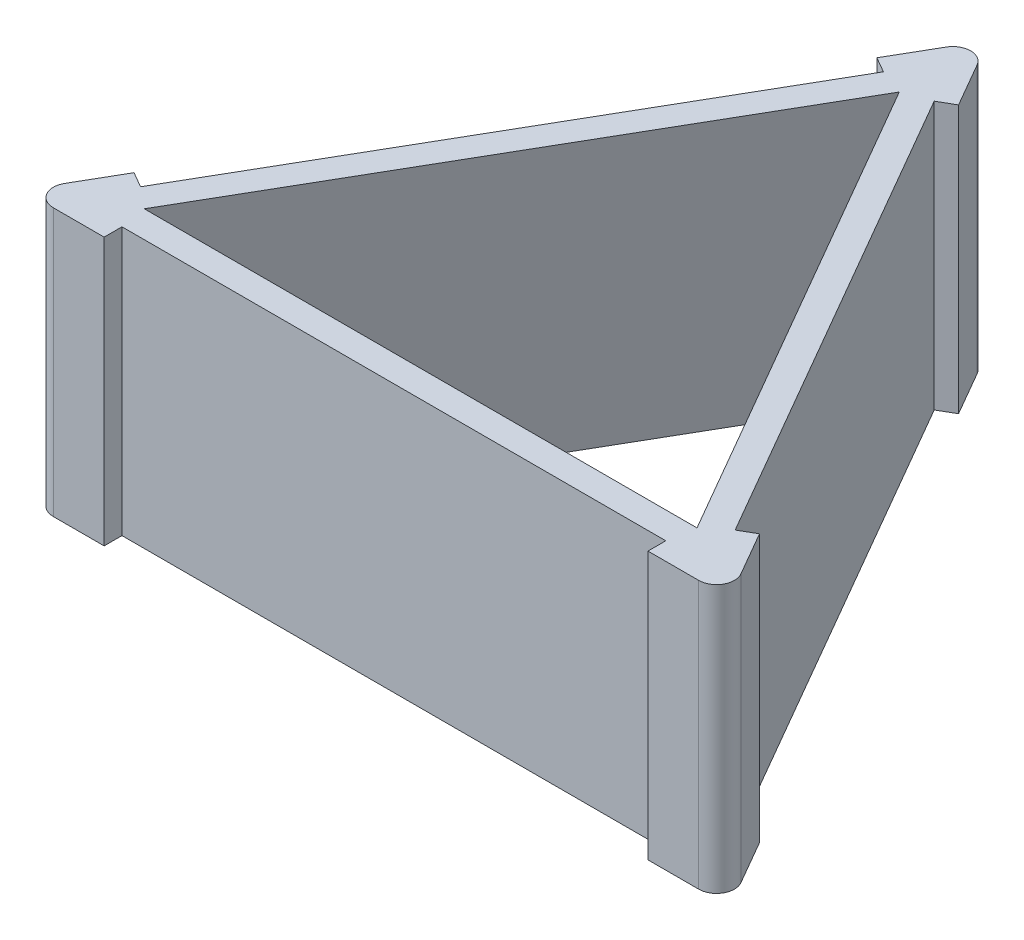
ISO-10303-21;
HEADER;
FILE_DESCRIPTION(('STEP AP214'),'2;1');
FILE_NAME('part.step','',(''),(''),'','','');
FILE_SCHEMA(('AUTOMOTIVE_DESIGN { 1 0 10303 214 1 1 1 1 }'));
ENDSEC;
DATA;
#1=APPLICATION_CONTEXT('core data for automotive mechanical design processes');
#2=APPLICATION_PROTOCOL_DEFINITION('international standard','automotive_design',2000,#1);
#3=PRODUCT_CONTEXT('',#1,'mechanical');
#4=PRODUCT('Part','Part','',(#3));
#5=PRODUCT_RELATED_PRODUCT_CATEGORY('part','',(#4));
#6=PRODUCT_DEFINITION_FORMATION('','',#4);
#7=PRODUCT_DEFINITION_CONTEXT('part definition',#1,'design');
#8=PRODUCT_DEFINITION('design','',#6,#7);
#9=PRODUCT_DEFINITION_SHAPE('','',#8);
#10=(LENGTH_UNIT() NAMED_UNIT(*) SI_UNIT(.MILLI.,.METRE.));
#11=(NAMED_UNIT(*) PLANE_ANGLE_UNIT() SI_UNIT($,.RADIAN.));
#12=(NAMED_UNIT(*) SI_UNIT($,.STERADIAN.) SOLID_ANGLE_UNIT());
#13=UNCERTAINTY_MEASURE_WITH_UNIT(LENGTH_MEASURE(1.E-05),#10,'distance_accuracy_value','');
#14=(GEOMETRIC_REPRESENTATION_CONTEXT(3) GLOBAL_UNCERTAINTY_ASSIGNED_CONTEXT((#13)) GLOBAL_UNIT_ASSIGNED_CONTEXT((#10,
#11,#12)) REPRESENTATION_CONTEXT('',''));
#15=CARTESIAN_POINT('',(0.,0.,0.));
#16=DIRECTION('',(0.,0.,1.));
#17=DIRECTION('',(1.,0.,0.));
#18=AXIS2_PLACEMENT_3D('',#15,#16,#17);
#19=CARTESIAN_POINT('',(50.3685226280623,19.05,29.0802800979955));
#20=DIRECTION('',(-0.866025403784438,0.,0.500000000000001));
#21=DIRECTION('',(0.500000000000001,0.,0.866025403784438));
#22=AXIS2_PLACEMENT_3D('',#19,#20,#21);
#23=PLANE('',#22);
#24=DIRECTION('',(-0.500000000000001,0.,-0.866025403784438));
#25=VECTOR('',#24,1.);
#26=CARTESIAN_POINT('',(50.3685226280623,-19.05,29.0802800979955));
#27=LINE('',#26,#25);
#28=CARTESIAN_POINT('',(5.81676131403093,-19.05,-48.085634064588));
#29=VERTEX_POINT('',#28);
#30=CARTESIAN_POINT('',(2.19970452561231,-19.05,-54.3505601959912));
#31=VERTEX_POINT('',#30);
#32=EDGE_CURVE('E298',#29,#31,#27,.T.);
#33=ORIENTED_EDGE('',*,*,#32,.T.);
#34=DIRECTION('',(0.,-1.,0.));
#35=VECTOR('',#34,1.);
#36=CARTESIAN_POINT('',(2.19970452561231,19.05,-54.3505601959911));
#37=LINE('',#36,#35);
#38=CARTESIAN_POINT('',(2.19970452561231,19.05,-54.3505601959912));
#39=VERTEX_POINT('',#38);
#40=EDGE_CURVE('E325',#31,#39,#37,.F.);
#41=ORIENTED_EDGE('',*,*,#40,.T.);
#42=DIRECTION('',(-0.500000000000001,0.,-0.866025403784438));
#43=VECTOR('',#42,1.);
#44=CARTESIAN_POINT('',(50.3685226280623,19.05,29.0802800979955));
#45=LINE('',#44,#43);
#46=CARTESIAN_POINT('',(5.81676131403093,19.05,-48.085634064588));
#47=VERTEX_POINT('',#46);
#48=EDGE_CURVE('E302',#47,#39,#45,.T.);
#49=ORIENTED_EDGE('',*,*,#48,.F.);
#50=DIRECTION('',(0.,1.,0.));
#51=VECTOR('',#50,1.);
#52=CARTESIAN_POINT('',(5.81676131403093,19.05,-48.085634064588));
#53=LINE('',#52,#51);
#54=EDGE_CURVE('E184',#29,#47,#53,.T.);
#55=ORIENTED_EDGE('',*,*,#54,.F.);
#56=EDGE_LOOP('',(#33,#41,#49,#55));
#57=FACE_BOUND('',#56,.T.);
#58=ADVANCED_FACE('F35',(#57),#23,.F.);
#59=CARTESIAN_POINT('',(-1.66750294128271E-13,19.05,-58.1605601959912));
#60=DIRECTION('',(0.866025403784439,0.,0.499999999999999));
#61=DIRECTION('',(0.499999999999999,0.,-0.866025403784439));
#62=AXIS2_PLACEMENT_3D('',#59,#60,#61);
#63=PLANE('',#62);
#64=DIRECTION('',(-0.499999999999999,0.,0.866025403784439));
#65=VECTOR('',#64,1.);
#66=CARTESIAN_POINT('',(-1.66750294128271E-13,-19.05,-58.1605601959912));
#67=LINE('',#66,#65);
#68=CARTESIAN_POINT('',(-44.551761314031,-19.05,19.0053539665929));
#69=VERTEX_POINT('',#68);
#70=CARTESIAN_POINT('',(-48.16881810245,-19.05,25.2702800979955));
#71=VERTEX_POINT('',#70);
#72=EDGE_CURVE('E311',#69,#71,#67,.T.);
#73=ORIENTED_EDGE('',*,*,#72,.T.);
#74=DIRECTION('',(0.,-1.,0.));
#75=VECTOR('',#74,1.);
#76=CARTESIAN_POINT('',(-48.16881810245,19.05,25.2702800979955));
#77=LINE('',#76,#75);
#78=CARTESIAN_POINT('',(-48.16881810245,19.05,25.2702800979955));
#79=VERTEX_POINT('',#78);
#80=EDGE_CURVE('E11',#71,#79,#77,.F.);
#81=ORIENTED_EDGE('',*,*,#80,.T.);
#82=DIRECTION('',(-0.499999999999999,0.,0.866025403784439));
#83=VECTOR('',#82,1.);
#84=CARTESIAN_POINT('',(-1.66750294128271E-13,19.05,-58.1605601959912));
#85=LINE('',#84,#83);
#86=CARTESIAN_POINT('',(-44.551761314031,19.05,19.0053539665929));
#87=VERTEX_POINT('',#86);
#88=EDGE_CURVE('E301',#87,#79,#85,.T.);
#89=ORIENTED_EDGE('',*,*,#88,.F.);
#90=DIRECTION('',(0.,1.,0.));
#91=VECTOR('',#90,1.);
#92=CARTESIAN_POINT('',(-44.551761314031,19.05,19.0053539665929));
#93=LINE('',#92,#91);
#94=EDGE_CURVE('E234',#69,#87,#93,.T.);
#95=ORIENTED_EDGE('',*,*,#94,.F.);
#96=EDGE_LOOP('',(#73,#81,#89,#95));
#97=FACE_BOUND('',#96,.T.);
#98=ADVANCED_FACE('F362',(#97),#63,.F.);
#99=CARTESIAN_POINT('',(-50.3685226280624,19.05,29.0802800979955));
#100=DIRECTION('',(0.,0.,-1.));
#101=DIRECTION('',(-1.,0.,0.));
#102=AXIS2_PLACEMENT_3D('',#99,#100,#101);
#103=PLANE('',#102);
#104=DIRECTION('',(1.,0.,0.));
#105=VECTOR('',#104,1.);
#106=CARTESIAN_POINT('',(-50.3685226280624,-19.05,29.0802800979955));
#107=LINE('',#106,#105);
#108=CARTESIAN_POINT('',(38.735,-19.05,29.0802800979955));
#109=VERTEX_POINT('',#108);
#110=CARTESIAN_POINT('',(45.9691135768374,-19.05,29.0802800979955));
#111=VERTEX_POINT('',#110);
#112=EDGE_CURVE('E314',#109,#111,#107,.T.);
#113=ORIENTED_EDGE('',*,*,#112,.T.);
#114=DIRECTION('',(0.,-1.,0.));
#115=VECTOR('',#114,1.);
#116=CARTESIAN_POINT('',(45.9691135768374,19.05,29.0802800979955));
#117=LINE('',#116,#115);
#118=CARTESIAN_POINT('',(45.9691135768374,19.05,29.0802800979955));
#119=VERTEX_POINT('',#118);
#120=EDGE_CURVE('E58',#111,#119,#117,.F.);
#121=ORIENTED_EDGE('',*,*,#120,.T.);
#122=DIRECTION('',(1.,0.,0.));
#123=VECTOR('',#122,1.);
#124=CARTESIAN_POINT('',(-50.3685226280624,19.05,29.0802800979955));
#125=LINE('',#124,#123);
#126=CARTESIAN_POINT('',(38.735,19.05,29.0802800979955));
#127=VERTEX_POINT('',#126);
#128=EDGE_CURVE('E305',#127,#119,#125,.T.);
#129=ORIENTED_EDGE('',*,*,#128,.F.);
#130=DIRECTION('',(0.,1.,0.));
#131=VECTOR('',#130,1.);
#132=CARTESIAN_POINT('',(38.735,19.05,29.0802800979955));
#133=LINE('',#132,#131);
#134=EDGE_CURVE('E215',#109,#127,#133,.T.);
#135=ORIENTED_EDGE('',*,*,#134,.F.);
#136=EDGE_LOOP('',(#113,#121,#129,#135));
#137=FACE_BOUND('',#136,.T.);
#138=ADVANCED_FACE('F397',(#137),#103,.F.);
#139=CARTESIAN_POINT('',(0.,19.05,0.));
#140=DIRECTION('',(0.,1.,0.));
#141=DIRECTION('',(0.,0.,1.));
#142=AXIS2_PLACEMENT_3D('',#139,#140,#141);
#143=PLANE('',#142);
#144=ORIENTED_EDGE('',*,*,#48,.T.);
#145=CARTESIAN_POINT('',(-1.7130394325271E-13,19.05,-53.0805601959911));
#146=DIRECTION('',(0.,1.,0.));
#147=DIRECTION('',(0.,0.,1.));
#148=AXIS2_PLACEMENT_3D('',#145,#146,#147);
#149=CIRCLE('',#148,2.54);
#150=CARTESIAN_POINT('',(-2.19970452561265,19.05,-54.3505601959911));
#151=VERTEX_POINT('',#150);
#152=EDGE_CURVE('E330',#39,#151,#149,.T.);
#153=ORIENTED_EDGE('',*,*,#152,.T.);
#154=CARTESIAN_POINT('',(-5.8167613140314,19.05,-48.0856340645879));
#155=VERTEX_POINT('',#154);
#156=EDGE_CURVE('E303',#151,#155,#85,.T.);
#157=ORIENTED_EDGE('',*,*,#156,.T.);
#158=DIRECTION('',(-0.866025403784443,0.,-0.499999999999992));
#159=VECTOR('',#158,1.);
#160=CARTESIAN_POINT('',(-3.61705678841911,19.05,-46.815634064588));
#161=LINE('',#160,#159);
#162=CARTESIAN_POINT('',(-3.61705678841911,19.05,-46.815634064588));
#163=VERTEX_POINT('',#162);
#164=EDGE_CURVE('E242',#163,#155,#161,.T.);
#165=ORIENTED_EDGE('',*,*,#164,.F.);
#166=DIRECTION('',(0.499999999999992,0.,-0.866025403784443));
#167=VECTOR('',#166,1.);
#168=CARTESIAN_POINT('',(-3.61705678841911,19.05,-46.815634064588));
#169=LINE('',#168,#167);
#170=CARTESIAN_POINT('',(-42.3520567884185,19.05,20.2753539665929));
#171=VERTEX_POINT('',#170);
#172=EDGE_CURVE('E223',#171,#163,#169,.T.);
#173=ORIENTED_EDGE('',*,*,#172,.F.);
#174=DIRECTION('',(-0.866025403784443,0.,-0.499999999999992));
#175=VECTOR('',#174,1.);
#176=CARTESIAN_POINT('',(-42.3520567884185,19.05,20.2753539665929));
#177=LINE('',#176,#175);
#178=EDGE_CURVE('E233',#171,#87,#177,.T.);
#179=ORIENTED_EDGE('',*,*,#178,.T.);
#180=ORIENTED_EDGE('',*,*,#88,.T.);
#181=CARTESIAN_POINT('',(-45.9691135768375,19.05,26.5402800979955));
#182=DIRECTION('',(0.,1.,0.));
#183=DIRECTION('',(0.,0.,1.));
#184=AXIS2_PLACEMENT_3D('',#181,#182,#183);
#185=CIRCLE('',#184,2.54);
#186=CARTESIAN_POINT('',(-45.9691135768375,19.05,29.0802800979955));
#187=VERTEX_POINT('',#186);
#188=EDGE_CURVE('E327',#79,#187,#185,.T.);
#189=ORIENTED_EDGE('',*,*,#188,.T.);
#190=CARTESIAN_POINT('',(-38.735,19.05,29.0802800979955));
#191=VERTEX_POINT('',#190);
#192=EDGE_CURVE('E306',#187,#191,#125,.T.);
#193=ORIENTED_EDGE('',*,*,#192,.T.);
#194=DIRECTION('',(0.,0.,1.));
#195=VECTOR('',#194,1.);
#196=CARTESIAN_POINT('',(-38.735,19.05,26.5402800979955));
#197=LINE('',#196,#195);
#198=CARTESIAN_POINT('',(-38.735,19.05,26.5402800979955));
#199=VERTEX_POINT('',#198);
#200=EDGE_CURVE('E270',#199,#191,#197,.T.);
#201=ORIENTED_EDGE('',*,*,#200,.F.);
#202=DIRECTION('',(-1.,0.,0.));
#203=VECTOR('',#202,1.);
#204=CARTESIAN_POINT('',(-38.735,19.05,26.5402800979955));
#205=LINE('',#204,#203);
#206=CARTESIAN_POINT('',(38.735,19.05,26.5402800979955));
#207=VERTEX_POINT('',#206);
#208=EDGE_CURVE('E250',#207,#199,#205,.T.);
#209=ORIENTED_EDGE('',*,*,#208,.F.);
#210=DIRECTION('',(0.,0.,1.));
#211=VECTOR('',#210,1.);
#212=CARTESIAN_POINT('',(38.735,19.05,26.5402800979955));
#213=LINE('',#212,#211);
#214=EDGE_CURVE('E260',#207,#127,#213,.T.);
#215=ORIENTED_EDGE('',*,*,#214,.T.);
#216=ORIENTED_EDGE('',*,*,#128,.T.);
#217=CARTESIAN_POINT('',(45.9691135768374,19.05,26.5402800979955));
#218=DIRECTION('',(0.,1.,0.));
#219=DIRECTION('',(0.,0.,1.));
#220=AXIS2_PLACEMENT_3D('',#217,#218,#219);
#221=CIRCLE('',#220,2.54);
#222=CARTESIAN_POINT('',(48.1688181024498,19.05,25.2702800979955));
#223=VERTEX_POINT('',#222);
#224=EDGE_CURVE('E50',#119,#223,#221,.T.);
#225=ORIENTED_EDGE('',*,*,#224,.T.);
#226=CARTESIAN_POINT('',(44.5517613140312,19.05,19.0053539665926));
#227=VERTEX_POINT('',#226);
#228=EDGE_CURVE('E299',#223,#227,#45,.T.);
#229=ORIENTED_EDGE('',*,*,#228,.T.);
#230=DIRECTION('',(0.866025403784436,0.,-0.500000000000004));
#231=VECTOR('',#230,1.);
#232=CARTESIAN_POINT('',(42.3520567884188,19.05,20.2753539665923));
#233=LINE('',#232,#231);
#234=CARTESIAN_POINT('',(42.3520567884188,19.05,20.2753539665923));
#235=VERTEX_POINT('',#234);
#236=EDGE_CURVE('E188',#235,#227,#233,.T.);
#237=ORIENTED_EDGE('',*,*,#236,.F.);
#238=DIRECTION('',(0.500000000000004,0.,0.866025403784436));
#239=VECTOR('',#238,1.);
#240=CARTESIAN_POINT('',(42.3520567884188,19.05,20.2753539665923));
#241=LINE('',#240,#239);
#242=CARTESIAN_POINT('',(3.61705678841846,19.05,-46.815634064588));
#243=VERTEX_POINT('',#242);
#244=EDGE_CURVE('E195',#243,#235,#241,.T.);
#245=ORIENTED_EDGE('',*,*,#244,.F.);
#246=DIRECTION('',(0.866025403784436,0.,-0.500000000000004));
#247=VECTOR('',#246,1.);
#248=CARTESIAN_POINT('',(3.61705678841846,19.05,-46.815634064588));
#249=LINE('',#248,#247);
#250=EDGE_CURVE('E178',#243,#47,#249,.T.);
#251=ORIENTED_EDGE('',*,*,#250,.T.);
#252=EDGE_LOOP('',(#144,#153,#157,#165,#173,#179,#180,#189,#193,#201,#209,#215,#216,#225,#229,
#237,#245,#251));
#253=FACE_BOUND('',#252,.T.);
#254=DIRECTION('',(1.,0.,0.));
#255=VECTOR('',#254,1.);
#256=CARTESIAN_POINT('',(-39.3700000000001,19.05,22.7302800979955));
#257=LINE('',#256,#255);
#258=CARTESIAN_POINT('',(-39.3700000000001,19.05,22.7302800979955));
#259=VERTEX_POINT('',#258);
#260=CARTESIAN_POINT('',(39.3699999999999,19.05,22.7302800979955));
#261=VERTEX_POINT('',#260);
#262=EDGE_CURVE('E277',#259,#261,#257,.T.);
#263=ORIENTED_EDGE('',*,*,#262,.F.);
#264=DIRECTION('',(-0.5,0.,0.866025403784439));
#265=VECTOR('',#264,1.);
#266=CARTESIAN_POINT('',(0.,19.05,-45.4605601959912));
#267=LINE('',#266,#265);
#268=CARTESIAN_POINT('',(0.,19.05,-45.4605601959912));
#269=VERTEX_POINT('',#268);
#270=EDGE_CURVE('E275',#269,#259,#267,.T.);
#271=ORIENTED_EDGE('',*,*,#270,.F.);
#272=DIRECTION('',(-0.5,0.,-0.866025403784439));
#273=VECTOR('',#272,1.);
#274=CARTESIAN_POINT('',(39.3699999999999,19.05,22.7302800979955));
#275=LINE('',#274,#273);
#276=EDGE_CURVE('E281',#261,#269,#275,.T.);
#277=ORIENTED_EDGE('',*,*,#276,.F.);
#278=EDGE_LOOP('',(#263,#271,#277));
#279=FACE_BOUND('',#278,.T.);
#280=ADVANCED_FACE('F201',(#253,#279),#143,.T.);
#281=CARTESIAN_POINT('',(0.,-19.05,0.));
#282=DIRECTION('',(0.,1.,0.));
#283=DIRECTION('',(0.,0.,1.));
#284=AXIS2_PLACEMENT_3D('',#281,#282,#283);
#285=PLANE('',#284);
#286=CARTESIAN_POINT('',(-2.19970452561265,-19.05,-54.3505601959911));
#287=VERTEX_POINT('',#286);
#288=CARTESIAN_POINT('',(-5.8167613140316,-19.05,-48.0856340645879));
#289=VERTEX_POINT('',#288);
#290=EDGE_CURVE('E312',#287,#289,#67,.T.);
#291=ORIENTED_EDGE('',*,*,#290,.F.);
#292=CARTESIAN_POINT('',(-1.7130394325271E-13,-19.05,-53.0805601959911));
#293=DIRECTION('',(0.,1.,0.));
#294=DIRECTION('',(0.,0.,1.));
#295=AXIS2_PLACEMENT_3D('',#292,#293,#294);
#296=CIRCLE('',#295,2.54);
#297=EDGE_CURVE('E323',#287,#31,#296,.F.);
#298=ORIENTED_EDGE('',*,*,#297,.T.);
#299=ORIENTED_EDGE('',*,*,#32,.F.);
#300=DIRECTION('',(0.866025403784436,0.,-0.500000000000004));
#301=VECTOR('',#300,1.);
#302=CARTESIAN_POINT('',(3.61705678841846,-19.05,-46.815634064588));
#303=LINE('',#302,#301);
#304=CARTESIAN_POINT('',(3.61705678841846,-19.05,-46.815634064588));
#305=VERTEX_POINT('',#304);
#306=EDGE_CURVE('E213',#305,#29,#303,.T.);
#307=ORIENTED_EDGE('',*,*,#306,.F.);
#308=DIRECTION('',(-0.500000000000004,0.,-0.866025403784436));
#309=VECTOR('',#308,1.);
#310=CARTESIAN_POINT('',(42.3520567884188,-19.05,20.2753539665923));
#311=LINE('',#310,#309);
#312=CARTESIAN_POINT('',(42.3520567884188,-19.05,20.2753539665923));
#313=VERTEX_POINT('',#312);
#314=EDGE_CURVE('E189',#313,#305,#311,.T.);
#315=ORIENTED_EDGE('',*,*,#314,.F.);
#316=DIRECTION('',(0.866025403784436,0.,-0.500000000000004));
#317=VECTOR('',#316,1.);
#318=CARTESIAN_POINT('',(42.3520567884188,-19.05,20.2753539665923));
#319=LINE('',#318,#317);
#320=CARTESIAN_POINT('',(44.5517613140312,-19.05,19.0053539665923));
#321=VERTEX_POINT('',#320);
#322=EDGE_CURVE('E216',#313,#321,#319,.T.);
#323=ORIENTED_EDGE('',*,*,#322,.T.);
#324=CARTESIAN_POINT('',(48.1688181024498,-19.05,25.2702800979955));
#325=VERTEX_POINT('',#324);
#326=EDGE_CURVE('E309',#325,#321,#27,.T.);
#327=ORIENTED_EDGE('',*,*,#326,.F.);
#328=CARTESIAN_POINT('',(45.9691135768374,-19.05,26.5402800979955));
#329=DIRECTION('',(0.,1.,0.));
#330=DIRECTION('',(0.,0.,1.));
#331=AXIS2_PLACEMENT_3D('',#328,#329,#330);
#332=CIRCLE('',#331,2.54);
#333=EDGE_CURVE('E321',#325,#111,#332,.F.);
#334=ORIENTED_EDGE('',*,*,#333,.T.);
#335=ORIENTED_EDGE('',*,*,#112,.F.);
#336=DIRECTION('',(0.,0.,1.));
#337=VECTOR('',#336,1.);
#338=CARTESIAN_POINT('',(38.735,-19.05,26.5402800979955));
#339=LINE('',#338,#337);
#340=CARTESIAN_POINT('',(38.735,-19.05,26.5402800979955));
#341=VERTEX_POINT('',#340);
#342=EDGE_CURVE('E264',#341,#109,#339,.T.);
#343=ORIENTED_EDGE('',*,*,#342,.F.);
#344=DIRECTION('',(1.,0.,0.));
#345=VECTOR('',#344,1.);
#346=CARTESIAN_POINT('',(-38.735,-19.05,26.5402800979955));
#347=LINE('',#346,#345);
#348=CARTESIAN_POINT('',(-38.735,-19.05,26.5402800979955));
#349=VERTEX_POINT('',#348);
#350=EDGE_CURVE('E257',#349,#341,#347,.T.);
#351=ORIENTED_EDGE('',*,*,#350,.F.);
#352=DIRECTION('',(0.,0.,1.));
#353=VECTOR('',#352,1.);
#354=CARTESIAN_POINT('',(-38.735,-19.05,26.5402800979955));
#355=LINE('',#354,#353);
#356=CARTESIAN_POINT('',(-38.735,-19.05,29.0802800979955));
#357=VERTEX_POINT('',#356);
#358=EDGE_CURVE('E267',#349,#357,#355,.T.);
#359=ORIENTED_EDGE('',*,*,#358,.T.);
#360=CARTESIAN_POINT('',(-45.9691135768375,-19.05,29.0802800979955));
#361=VERTEX_POINT('',#360);
#362=EDGE_CURVE('E315',#361,#357,#107,.T.);
#363=ORIENTED_EDGE('',*,*,#362,.F.);
#364=CARTESIAN_POINT('',(-45.9691135768375,-19.05,26.5402800979955));
#365=DIRECTION('',(0.,1.,0.));
#366=DIRECTION('',(0.,0.,1.));
#367=AXIS2_PLACEMENT_3D('',#364,#365,#366);
#368=CIRCLE('',#367,2.54);
#369=EDGE_CURVE('E319',#361,#71,#368,.F.);
#370=ORIENTED_EDGE('',*,*,#369,.T.);
#371=ORIENTED_EDGE('',*,*,#72,.F.);
#372=DIRECTION('',(-0.866025403784443,0.,-0.499999999999992));
#373=VECTOR('',#372,1.);
#374=CARTESIAN_POINT('',(-42.3520567884185,-19.05,20.2753539665929));
#375=LINE('',#374,#373);
#376=CARTESIAN_POINT('',(-42.3520567884185,-19.05,20.2753539665929));
#377=VERTEX_POINT('',#376);
#378=EDGE_CURVE('E210',#377,#69,#375,.T.);
#379=ORIENTED_EDGE('',*,*,#378,.F.);
#380=DIRECTION('',(-0.499999999999992,0.,0.866025403784443));
#381=VECTOR('',#380,1.);
#382=CARTESIAN_POINT('',(-3.61705678841911,-19.05,-46.815634064588));
#383=LINE('',#382,#381);
#384=CARTESIAN_POINT('',(-3.61705678841911,-19.05,-46.815634064588));
#385=VERTEX_POINT('',#384);
#386=EDGE_CURVE('E230',#385,#377,#383,.T.);
#387=ORIENTED_EDGE('',*,*,#386,.F.);
#388=DIRECTION('',(-0.866025403784443,0.,-0.499999999999992));
#389=VECTOR('',#388,1.);
#390=CARTESIAN_POINT('',(-3.61705678841911,-19.05,-46.815634064588));
#391=LINE('',#390,#389);
#392=EDGE_CURVE('E239',#385,#289,#391,.T.);
#393=ORIENTED_EDGE('',*,*,#392,.T.);
#394=EDGE_LOOP('',(#291,#298,#299,#307,#315,#323,#327,#334,#335,#343,#351,#359,#363,#370,#371,
#379,#387,#393));
#395=FACE_BOUND('',#394,.T.);
#396=DIRECTION('',(-0.5,0.,0.866025403784439));
#397=VECTOR('',#396,1.);
#398=CARTESIAN_POINT('',(0.,-19.05,-45.4605601959912));
#399=LINE('',#398,#397);
#400=CARTESIAN_POINT('',(0.,-19.05,-45.4605601959912));
#401=VERTEX_POINT('',#400);
#402=CARTESIAN_POINT('',(-39.3700000000001,-19.05,22.7302800979955));
#403=VERTEX_POINT('',#402);
#404=EDGE_CURVE('E266',#401,#403,#399,.T.);
#405=ORIENTED_EDGE('',*,*,#404,.T.);
#406=DIRECTION('',(1.,0.,0.));
#407=VECTOR('',#406,1.);
#408=CARTESIAN_POINT('',(-39.3700000000001,-19.05,22.7302800979955));
#409=LINE('',#408,#407);
#410=CARTESIAN_POINT('',(39.3699999999999,-19.05,22.7302800979955));
#411=VERTEX_POINT('',#410);
#412=EDGE_CURVE('E286',#403,#411,#409,.T.);
#413=ORIENTED_EDGE('',*,*,#412,.T.);
#414=DIRECTION('',(-0.5,0.,-0.866025403784439));
#415=VECTOR('',#414,1.);
#416=CARTESIAN_POINT('',(39.3699999999999,-19.05,22.7302800979955));
#417=LINE('',#416,#415);
#418=EDGE_CURVE('E278',#411,#401,#417,.T.);
#419=ORIENTED_EDGE('',*,*,#418,.T.);
#420=EDGE_LOOP('',(#405,#413,#419));
#421=FACE_BOUND('',#420,.T.);
#422=ADVANCED_FACE('F346',(#395,#421),#285,.F.);
#423=ORIENTED_EDGE('',*,*,#228,.F.);
#424=DIRECTION('',(0.,-1.,0.));
#425=VECTOR('',#424,1.);
#426=CARTESIAN_POINT('',(48.1688181024498,19.05,25.2702800979955));
#427=LINE('',#426,#425);
#428=EDGE_CURVE('E332',#223,#325,#427,.T.);
#429=ORIENTED_EDGE('',*,*,#428,.T.);
#430=ORIENTED_EDGE('',*,*,#326,.T.);
#431=DIRECTION('',(0.,-1.,0.));
#432=VECTOR('',#431,1.);
#433=CARTESIAN_POINT('',(44.5517613140312,19.05,19.0053539665923));
#434=LINE('',#433,#432);
#435=EDGE_CURVE('E199',#227,#321,#434,.T.);
#436=ORIENTED_EDGE('',*,*,#435,.F.);
#437=EDGE_LOOP('',(#423,#429,#430,#436));
#438=FACE_BOUND('',#437,.T.);
#439=ADVANCED_FACE('F391',(#438),#23,.F.);
#440=ORIENTED_EDGE('',*,*,#156,.F.);
#441=DIRECTION('',(0.,-1.,0.));
#442=VECTOR('',#441,1.);
#443=CARTESIAN_POINT('',(-2.19970452561265,19.05,-54.3505601959911));
#444=LINE('',#443,#442);
#445=EDGE_CURVE('E308',#151,#287,#444,.T.);
#446=ORIENTED_EDGE('',*,*,#445,.T.);
#447=ORIENTED_EDGE('',*,*,#290,.T.);
#448=DIRECTION('',(0.,-1.,0.));
#449=VECTOR('',#448,1.);
#450=CARTESIAN_POINT('',(-5.8167613140316,19.05,-48.0856340645879));
#451=LINE('',#450,#449);
#452=EDGE_CURVE('E224',#155,#289,#451,.T.);
#453=ORIENTED_EDGE('',*,*,#452,.F.);
#454=EDGE_LOOP('',(#440,#446,#447,#453));
#455=FACE_BOUND('',#454,.T.);
#456=ADVANCED_FACE('F379',(#455),#63,.F.);
#457=ORIENTED_EDGE('',*,*,#192,.F.);
#458=DIRECTION('',(0.,-1.,0.));
#459=VECTOR('',#458,1.);
#460=CARTESIAN_POINT('',(-45.9691135768375,19.05,29.0802800979955));
#461=LINE('',#460,#459);
#462=EDGE_CURVE('E43',#187,#361,#461,.T.);
#463=ORIENTED_EDGE('',*,*,#462,.T.);
#464=ORIENTED_EDGE('',*,*,#362,.T.);
#465=DIRECTION('',(0.,-1.,0.));
#466=VECTOR('',#465,1.);
#467=CARTESIAN_POINT('',(-38.735,19.05,29.0802800979955));
#468=LINE('',#467,#466);
#469=EDGE_CURVE('E251',#191,#357,#468,.T.);
#470=ORIENTED_EDGE('',*,*,#469,.F.);
#471=EDGE_LOOP('',(#457,#463,#464,#470));
#472=FACE_BOUND('',#471,.T.);
#473=ADVANCED_FACE('F340',(#472),#103,.F.);
#474=CARTESIAN_POINT('',(0.,19.05,-45.4605601959912));
#475=DIRECTION('',(0.866025403784439,0.,0.5));
#476=DIRECTION('',(0.5,0.,-0.866025403784438));
#477=AXIS2_PLACEMENT_3D('',#474,#475,#476);
#478=PLANE('',#477);
#479=ORIENTED_EDGE('',*,*,#404,.F.);
#480=DIRECTION('',(0.,-1.,0.));
#481=VECTOR('',#480,1.);
#482=CARTESIAN_POINT('',(0.,19.05,-45.4605601959912));
#483=LINE('',#482,#481);
#484=EDGE_CURVE('E283',#269,#401,#483,.T.);
#485=ORIENTED_EDGE('',*,*,#484,.F.);
#486=ORIENTED_EDGE('',*,*,#270,.T.);
#487=DIRECTION('',(0.,-1.,0.));
#488=VECTOR('',#487,1.);
#489=CARTESIAN_POINT('',(-39.3700000000001,19.05,22.7302800979955));
#490=LINE('',#489,#488);
#491=EDGE_CURVE('E295',#259,#403,#490,.T.);
#492=ORIENTED_EDGE('',*,*,#491,.T.);
#493=EDGE_LOOP('',(#479,#485,#486,#492));
#494=FACE_BOUND('',#493,.T.);
#495=ADVANCED_FACE('F431',(#494),#478,.T.);
#496=CARTESIAN_POINT('',(-39.3700000000001,19.05,22.7302800979955));
#497=DIRECTION('',(0.,0.,-1.));
#498=DIRECTION('',(-1.,0.,0.));
#499=AXIS2_PLACEMENT_3D('',#496,#497,#498);
#500=PLANE('',#499);
#501=ORIENTED_EDGE('',*,*,#412,.F.);
#502=ORIENTED_EDGE('',*,*,#491,.F.);
#503=ORIENTED_EDGE('',*,*,#262,.T.);
#504=DIRECTION('',(0.,-1.,0.));
#505=VECTOR('',#504,1.);
#506=CARTESIAN_POINT('',(39.3699999999999,19.05,22.7302800979955));
#507=LINE('',#506,#505);
#508=EDGE_CURVE('E293',#261,#411,#507,.T.);
#509=ORIENTED_EDGE('',*,*,#508,.T.);
#510=EDGE_LOOP('',(#501,#502,#503,#509));
#511=FACE_BOUND('',#510,.T.);
#512=ADVANCED_FACE('F408',(#511),#500,.T.);
#513=CARTESIAN_POINT('',(39.3699999999999,19.05,22.7302800979955));
#514=DIRECTION('',(-0.866025403784439,0.,0.5));
#515=DIRECTION('',(0.5,0.,0.866025403784439));
#516=AXIS2_PLACEMENT_3D('',#513,#514,#515);
#517=PLANE('',#516);
#518=ORIENTED_EDGE('',*,*,#418,.F.);
#519=ORIENTED_EDGE('',*,*,#508,.F.);
#520=ORIENTED_EDGE('',*,*,#276,.T.);
#521=ORIENTED_EDGE('',*,*,#484,.T.);
#522=EDGE_LOOP('',(#518,#519,#520,#521));
#523=FACE_BOUND('',#522,.T.);
#524=ADVANCED_FACE('F401',(#523),#517,.T.);
#525=CARTESIAN_POINT('',(38.735,19.05,26.5402800979955));
#526=DIRECTION('',(1.,0.,0.));
#527=DIRECTION('',(0.,1.,0.));
#528=AXIS2_PLACEMENT_3D('',#525,#526,#527);
#529=PLANE('',#528);
#530=ORIENTED_EDGE('',*,*,#134,.T.);
#531=ORIENTED_EDGE('',*,*,#214,.F.);
#532=DIRECTION('',(0.,1.,0.));
#533=VECTOR('',#532,1.);
#534=CARTESIAN_POINT('',(38.735,19.05,26.5402800979955));
#535=LINE('',#534,#533);
#536=EDGE_CURVE('E247',#341,#207,#535,.T.);
#537=ORIENTED_EDGE('',*,*,#536,.F.);
#538=ORIENTED_EDGE('',*,*,#342,.T.);
#539=EDGE_LOOP('',(#530,#531,#537,#538));
#540=FACE_BOUND('',#539,.T.);
#541=ADVANCED_FACE('F399',(#540),#529,.F.);
#542=CARTESIAN_POINT('',(-38.735,19.05,26.5402800979955));
#543=DIRECTION('',(-1.,0.,0.));
#544=DIRECTION('',(0.,0.,1.));
#545=AXIS2_PLACEMENT_3D('',#542,#543,#544);
#546=PLANE('',#545);
#547=ORIENTED_EDGE('',*,*,#469,.T.);
#548=ORIENTED_EDGE('',*,*,#358,.F.);
#549=DIRECTION('',(0.,-1.,0.));
#550=VECTOR('',#549,1.);
#551=CARTESIAN_POINT('',(-38.735,19.05,26.5402800979955));
#552=LINE('',#551,#550);
#553=EDGE_CURVE('E254',#199,#349,#552,.T.);
#554=ORIENTED_EDGE('',*,*,#553,.F.);
#555=ORIENTED_EDGE('',*,*,#200,.T.);
#556=EDGE_LOOP('',(#547,#548,#554,#555));
#557=FACE_BOUND('',#556,.T.);
#558=ADVANCED_FACE('F353',(#557),#546,.F.);
#559=CARTESIAN_POINT('',(0.,0.,26.5402800979955));
#560=DIRECTION('',(0.,0.,1.));
#561=DIRECTION('',(1.,0.,0.));
#562=AXIS2_PLACEMENT_3D('',#559,#560,#561);
#563=PLANE('',#562);
#564=ORIENTED_EDGE('',*,*,#536,.T.);
#565=ORIENTED_EDGE('',*,*,#208,.T.);
#566=ORIENTED_EDGE('',*,*,#553,.T.);
#567=ORIENTED_EDGE('',*,*,#350,.T.);
#568=EDGE_LOOP('',(#564,#565,#566,#567));
#569=FACE_BOUND('',#568,.T.);
#570=ADVANCED_FACE('F355',(#569),#563,.T.);
#571=CARTESIAN_POINT('',(-42.3520567884185,19.05,20.2753539665929));
#572=DIRECTION('',(-0.499999999999992,0.,0.866025403784443));
#573=DIRECTION('',(0.866025403784443,0.,0.499999999999992));
#574=AXIS2_PLACEMENT_3D('',#571,#572,#573);
#575=PLANE('',#574);
#576=ORIENTED_EDGE('',*,*,#94,.T.);
#577=ORIENTED_EDGE('',*,*,#178,.F.);
#578=DIRECTION('',(0.,1.,0.));
#579=VECTOR('',#578,1.);
#580=CARTESIAN_POINT('',(-42.3520567884185,19.05,20.2753539665929));
#581=LINE('',#580,#579);
#582=EDGE_CURVE('E220',#377,#171,#581,.T.);
#583=ORIENTED_EDGE('',*,*,#582,.F.);
#584=ORIENTED_EDGE('',*,*,#378,.T.);
#585=EDGE_LOOP('',(#576,#577,#583,#584));
#586=FACE_BOUND('',#585,.T.);
#587=ADVANCED_FACE('F367',(#586),#575,.F.);
#588=CARTESIAN_POINT('',(-3.61705678841911,19.05,-46.815634064588));
#589=DIRECTION('',(0.499999999999992,0.,-0.866025403784443));
#590=DIRECTION('',(-0.866025403784443,0.,-0.499999999999992));
#591=AXIS2_PLACEMENT_3D('',#588,#589,#590);
#592=PLANE('',#591);
#593=ORIENTED_EDGE('',*,*,#452,.T.);
#594=ORIENTED_EDGE('',*,*,#392,.F.);
#595=DIRECTION('',(0.,-1.,0.));
#596=VECTOR('',#595,1.);
#597=CARTESIAN_POINT('',(-3.61705678841911,19.05,-46.815634064588));
#598=LINE('',#597,#596);
#599=EDGE_CURVE('E227',#163,#385,#598,.T.);
#600=ORIENTED_EDGE('',*,*,#599,.F.);
#601=ORIENTED_EDGE('',*,*,#164,.T.);
#602=EDGE_LOOP('',(#593,#594,#600,#601));
#603=FACE_BOUND('',#602,.T.);
#604=ADVANCED_FACE('F373',(#603),#592,.F.);
#605=CARTESIAN_POINT('',(-22.9845567884188,0.,-13.2701400489976));
#606=DIRECTION('',(-0.866025403784443,0.,-0.499999999999992));
#607=DIRECTION('',(-0.499999999999992,0.,0.866025403784443));
#608=AXIS2_PLACEMENT_3D('',#605,#606,#607);
#609=PLANE('',#608);
#610=ORIENTED_EDGE('',*,*,#582,.T.);
#611=ORIENTED_EDGE('',*,*,#172,.T.);
#612=ORIENTED_EDGE('',*,*,#599,.T.);
#613=ORIENTED_EDGE('',*,*,#386,.T.);
#614=EDGE_LOOP('',(#610,#611,#612,#613));
#615=FACE_BOUND('',#614,.T.);
#616=ADVANCED_FACE('F370',(#615),#609,.T.);
#617=CARTESIAN_POINT('',(3.61705678841846,19.05,-46.815634064588));
#618=DIRECTION('',(-0.500000000000004,0.,-0.866025403784436));
#619=DIRECTION('',(-0.866025403784436,0.,0.500000000000004));
#620=AXIS2_PLACEMENT_3D('',#617,#618,#619);
#621=PLANE('',#620);
#622=ORIENTED_EDGE('',*,*,#54,.T.);
#623=ORIENTED_EDGE('',*,*,#250,.F.);
#624=DIRECTION('',(0.,1.,0.));
#625=VECTOR('',#624,1.);
#626=CARTESIAN_POINT('',(3.61705678841846,19.05,-46.815634064588));
#627=LINE('',#626,#625);
#628=EDGE_CURVE('E181',#305,#243,#627,.T.);
#629=ORIENTED_EDGE('',*,*,#628,.F.);
#630=ORIENTED_EDGE('',*,*,#306,.T.);
#631=EDGE_LOOP('',(#622,#623,#629,#630));
#632=FACE_BOUND('',#631,.T.);
#633=ADVANCED_FACE('F180',(#632),#621,.F.);
#634=CARTESIAN_POINT('',(42.3520567884188,19.05,20.2753539665923));
#635=DIRECTION('',(0.500000000000004,0.,0.866025403784436));
#636=DIRECTION('',(0.866025403784436,0.,-0.500000000000004));
#637=AXIS2_PLACEMENT_3D('',#634,#635,#636);
#638=PLANE('',#637);
#639=ORIENTED_EDGE('',*,*,#435,.T.);
#640=ORIENTED_EDGE('',*,*,#322,.F.);
#641=DIRECTION('',(0.,-1.,0.));
#642=VECTOR('',#641,1.);
#643=CARTESIAN_POINT('',(42.3520567884188,19.05,20.2753539665923));
#644=LINE('',#643,#642);
#645=EDGE_CURVE('E204',#235,#313,#644,.T.);
#646=ORIENTED_EDGE('',*,*,#645,.F.);
#647=ORIENTED_EDGE('',*,*,#236,.T.);
#648=EDGE_LOOP('',(#639,#640,#646,#647));
#649=FACE_BOUND('',#648,.T.);
#650=ADVANCED_FACE('F388',(#649),#638,.F.);
#651=CARTESIAN_POINT('',(22.9845567884186,0.,-13.2701400489979));
#652=DIRECTION('',(0.866025403784436,0.,-0.500000000000004));
#653=DIRECTION('',(-0.500000000000004,0.,-0.866025403784436));
#654=AXIS2_PLACEMENT_3D('',#651,#652,#653);
#655=PLANE('',#654);
#656=ORIENTED_EDGE('',*,*,#628,.T.);
#657=ORIENTED_EDGE('',*,*,#244,.T.);
#658=ORIENTED_EDGE('',*,*,#645,.T.);
#659=ORIENTED_EDGE('',*,*,#314,.T.);
#660=EDGE_LOOP('',(#656,#657,#658,#659));
#661=FACE_BOUND('',#660,.T.);
#662=ADVANCED_FACE('F193',(#661),#655,.T.);
#663=CARTESIAN_POINT('',(-1.7130394325271E-13,19.05,-53.0805601959911));
#664=DIRECTION('',(0.,-1.,0.));
#665=DIRECTION('',(0.,0.,-1.));
#666=AXIS2_PLACEMENT_3D('',#663,#664,#665);
#667=CYLINDRICAL_SURFACE('',#666,2.54);
#668=ORIENTED_EDGE('',*,*,#152,.F.);
#669=ORIENTED_EDGE('',*,*,#40,.F.);
#670=ORIENTED_EDGE('',*,*,#297,.F.);
#671=ORIENTED_EDGE('',*,*,#445,.F.);
#672=EDGE_LOOP('',(#668,#669,#670,#671));
#673=FACE_BOUND('',#672,.T.);
#674=ADVANCED_FACE('F383',(#673),#667,.T.);
#675=CARTESIAN_POINT('',(45.9691135768374,19.05,26.5402800979955));
#676=DIRECTION('',(0.,-1.,0.));
#677=DIRECTION('',(0.,0.,-1.));
#678=AXIS2_PLACEMENT_3D('',#675,#676,#677);
#679=CYLINDRICAL_SURFACE('',#678,2.54);
#680=ORIENTED_EDGE('',*,*,#224,.F.);
#681=ORIENTED_EDGE('',*,*,#120,.F.);
#682=ORIENTED_EDGE('',*,*,#333,.F.);
#683=ORIENTED_EDGE('',*,*,#428,.F.);
#684=EDGE_LOOP('',(#680,#681,#682,#683));
#685=FACE_BOUND('',#684,.T.);
#686=ADVANCED_FACE('F394',(#685),#679,.T.);
#687=CARTESIAN_POINT('',(-45.9691135768375,19.05,26.5402800979955));
#688=DIRECTION('',(0.,-1.,0.));
#689=DIRECTION('',(0.,0.,-1.));
#690=AXIS2_PLACEMENT_3D('',#687,#688,#689);
#691=CYLINDRICAL_SURFACE('',#690,2.54);
#692=ORIENTED_EDGE('',*,*,#188,.F.);
#693=ORIENTED_EDGE('',*,*,#80,.F.);
#694=ORIENTED_EDGE('',*,*,#369,.F.);
#695=ORIENTED_EDGE('',*,*,#462,.F.);
#696=EDGE_LOOP('',(#692,#693,#694,#695));
#697=FACE_BOUND('',#696,.T.);
#698=ADVANCED_FACE('F37',(#697),#691,.T.);
#699=CLOSED_SHELL('',(#58,#98,#138,#280,#422,#439,#456,#473,#495,#512,#524,#541,#558,#570,#587,
#604,#616,#633,#650,#662,#674,#686,#698));
#700=MANIFOLD_SOLID_BREP('B2',#699);
#701=ADVANCED_BREP_SHAPE_REPRESENTATION('',(#18,#700),#14);
#702=SHAPE_DEFINITION_REPRESENTATION(#9,#701);
ENDSEC;
END-ISO-10303-21;
